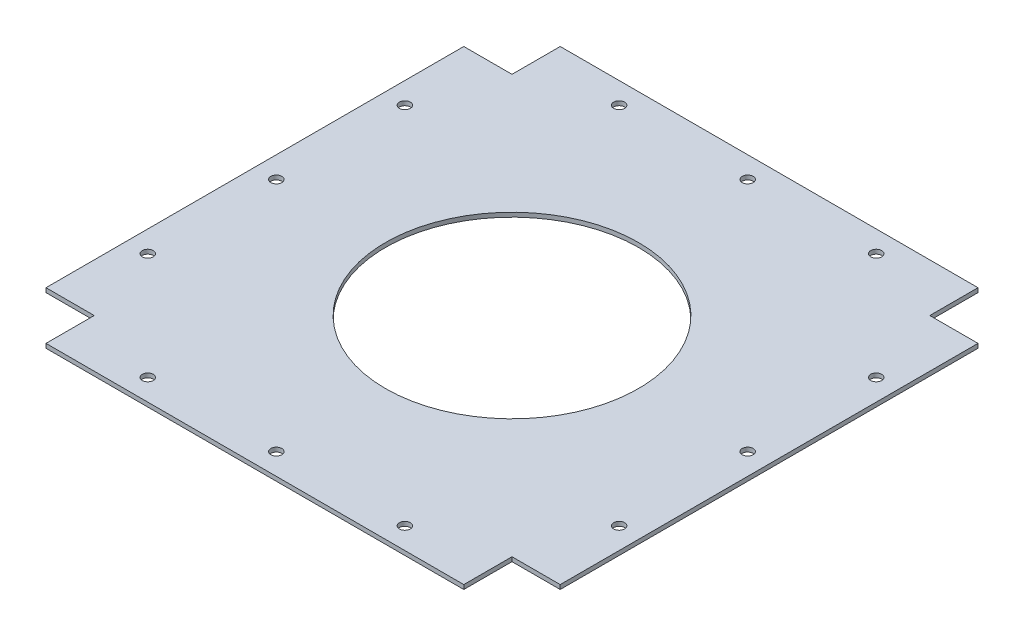
ISO-10303-21;
HEADER;
FILE_DESCRIPTION(('STEP AP214'),'2;1');
FILE_NAME('part.step','',(''),(''),'','','');
FILE_SCHEMA(('AUTOMOTIVE_DESIGN { 1 0 10303 214 1 1 1 1 }'));
ENDSEC;
DATA;
#1=APPLICATION_CONTEXT('core data for automotive mechanical design processes');
#2=APPLICATION_PROTOCOL_DEFINITION('international standard','automotive_design',2000,#1);
#3=PRODUCT_CONTEXT('',#1,'mechanical');
#4=PRODUCT('Part','Part','',(#3));
#5=PRODUCT_RELATED_PRODUCT_CATEGORY('part','',(#4));
#6=PRODUCT_DEFINITION_FORMATION('','',#4);
#7=PRODUCT_DEFINITION_CONTEXT('part definition',#1,'design');
#8=PRODUCT_DEFINITION('design','',#6,#7);
#9=PRODUCT_DEFINITION_SHAPE('','',#8);
#10=(LENGTH_UNIT() NAMED_UNIT(*) SI_UNIT(.MILLI.,.METRE.));
#11=(NAMED_UNIT(*) PLANE_ANGLE_UNIT() SI_UNIT($,.RADIAN.));
#12=(NAMED_UNIT(*) SI_UNIT($,.STERADIAN.) SOLID_ANGLE_UNIT());
#13=UNCERTAINTY_MEASURE_WITH_UNIT(LENGTH_MEASURE(1.E-05),#10,'distance_accuracy_value','');
#14=(GEOMETRIC_REPRESENTATION_CONTEXT(3) GLOBAL_UNCERTAINTY_ASSIGNED_CONTEXT((#13)) GLOBAL_UNIT_ASSIGNED_CONTEXT((#10,
#11,#12)) REPRESENTATION_CONTEXT('',''));
#15=CARTESIAN_POINT('',(0.,0.,0.));
#16=DIRECTION('',(0.,0.,1.));
#17=DIRECTION('',(1.,0.,0.));
#18=AXIS2_PLACEMENT_3D('',#15,#16,#17);
#19=CARTESIAN_POINT('',(0.,2.54,0.));
#20=DIRECTION('',(0.,-1.,0.));
#21=DIRECTION('',(0.,0.,-1.));
#22=AXIS2_PLACEMENT_3D('',#19,#20,#21);
#23=PLANE('',#22);
#24=CARTESIAN_POINT('',(-139.7,2.54,76.1999999999999));
#25=DIRECTION('',(0.,1.,0.));
#26=DIRECTION('',(0.,0.,-1.));
#27=AXIS2_PLACEMENT_3D('',#24,#25,#26);
#28=CIRCLE('',#27,3.23850000000002);
#29=CARTESIAN_POINT('',(-139.7,2.54,72.9614999999999));
#30=VERTEX_POINT('',#29);
#31=EDGE_CURVE('E330',#30,#30,#28,.T.);
#32=ORIENTED_EDGE('',*,*,#31,.F.);
#33=EDGE_LOOP('',(#32));
#34=FACE_BOUND('',#33,.T.);
#35=CARTESIAN_POINT('',(-139.7,2.54,-76.2));
#36=DIRECTION('',(0.,1.,0.));
#37=DIRECTION('',(0.,0.,-1.));
#38=AXIS2_PLACEMENT_3D('',#35,#36,#37);
#39=CIRCLE('',#38,3.23850000000001);
#40=CARTESIAN_POINT('',(-139.7,2.54,-79.4385));
#41=VERTEX_POINT('',#40);
#42=EDGE_CURVE('E342',#41,#41,#39,.T.);
#43=ORIENTED_EDGE('',*,*,#42,.F.);
#44=EDGE_LOOP('',(#43));
#45=FACE_BOUND('',#44,.T.);
#46=CARTESIAN_POINT('',(139.7,2.54,-1.11022302462516E-13));
#47=DIRECTION('',(0.,1.,0.));
#48=DIRECTION('',(0.,0.,1.));
#49=AXIS2_PLACEMENT_3D('',#46,#47,#48);
#50=CIRCLE('',#49,3.23850000000011);
#51=CARTESIAN_POINT('',(139.7,2.54,3.2385));
#52=VERTEX_POINT('',#51);
#53=EDGE_CURVE('E354',#52,#52,#50,.T.);
#54=ORIENTED_EDGE('',*,*,#53,.F.);
#55=EDGE_LOOP('',(#54));
#56=FACE_BOUND('',#55,.T.);
#57=CARTESIAN_POINT('',(76.2,2.54,139.7));
#58=DIRECTION('',(0.,1.,0.));
#59=DIRECTION('',(0.,0.,-1.));
#60=AXIS2_PLACEMENT_3D('',#57,#58,#59);
#61=CIRCLE('',#60,3.23850000000002);
#62=CARTESIAN_POINT('',(76.2,2.54,136.4615));
#63=VERTEX_POINT('',#62);
#64=EDGE_CURVE('E366',#63,#63,#61,.T.);
#65=ORIENTED_EDGE('',*,*,#64,.F.);
#66=EDGE_LOOP('',(#65));
#67=FACE_BOUND('',#66,.T.);
#68=CARTESIAN_POINT('',(-76.2,2.54,139.7));
#69=DIRECTION('',(0.,1.,0.));
#70=DIRECTION('',(0.,0.,-1.));
#71=AXIS2_PLACEMENT_3D('',#68,#69,#70);
#72=CIRCLE('',#71,3.23849999999999);
#73=CARTESIAN_POINT('',(-76.2,2.54,136.4615));
#74=VERTEX_POINT('',#73);
#75=EDGE_CURVE('E378',#74,#74,#72,.T.);
#76=ORIENTED_EDGE('',*,*,#75,.F.);
#77=EDGE_LOOP('',(#76));
#78=FACE_BOUND('',#77,.T.);
#79=CARTESIAN_POINT('',(0.,2.54,-139.7));
#80=DIRECTION('',(0.,1.,0.));
#81=DIRECTION('',(0.,0.,1.));
#82=AXIS2_PLACEMENT_3D('',#79,#80,#81);
#83=CIRCLE('',#82,3.2385);
#84=CARTESIAN_POINT('',(0.,2.54,-136.4615));
#85=VERTEX_POINT('',#84);
#86=EDGE_CURVE('E390',#85,#85,#83,.T.);
#87=ORIENTED_EDGE('',*,*,#86,.F.);
#88=EDGE_LOOP('',(#87));
#89=FACE_BOUND('',#88,.T.);
#90=DIRECTION('',(-1.,0.,0.));
#91=VECTOR('',#90,1.);
#92=CARTESIAN_POINT('',(-123.825,2.54,-152.4));
#93=LINE('',#92,#91);
#94=CARTESIAN_POINT('',(123.825,2.54,-152.4));
#95=VERTEX_POINT('',#94);
#96=CARTESIAN_POINT('',(-123.825,2.54,-152.4));
#97=VERTEX_POINT('',#96);
#98=EDGE_CURVE('E179',#95,#97,#93,.T.);
#99=ORIENTED_EDGE('',*,*,#98,.T.);
#100=DIRECTION('',(0.,0.,1.));
#101=VECTOR('',#100,1.);
#102=CARTESIAN_POINT('',(-123.825,2.54,-123.825));
#103=LINE('',#102,#101);
#104=CARTESIAN_POINT('',(-123.825,2.54,-123.825));
#105=VERTEX_POINT('',#104);
#106=EDGE_CURVE('E107',#97,#105,#103,.T.);
#107=ORIENTED_EDGE('',*,*,#106,.T.);
#108=DIRECTION('',(-1.,0.,0.));
#109=VECTOR('',#108,1.);
#110=CARTESIAN_POINT('',(-152.4,2.54,-123.825));
#111=LINE('',#110,#109);
#112=CARTESIAN_POINT('',(-152.4,2.54,-123.825));
#113=VERTEX_POINT('',#112);
#114=EDGE_CURVE('E206',#105,#113,#111,.T.);
#115=ORIENTED_EDGE('',*,*,#114,.T.);
#116=DIRECTION('',(0.,0.,1.));
#117=VECTOR('',#116,1.);
#118=CARTESIAN_POINT('',(-152.4,2.54,123.825));
#119=LINE('',#118,#117);
#120=CARTESIAN_POINT('',(-152.4,2.54,123.825));
#121=VERTEX_POINT('',#120);
#122=EDGE_CURVE('E225',#113,#121,#119,.T.);
#123=ORIENTED_EDGE('',*,*,#122,.T.);
#124=DIRECTION('',(1.,0.,0.));
#125=VECTOR('',#124,1.);
#126=CARTESIAN_POINT('',(-152.4,2.54,123.825));
#127=LINE('',#126,#125);
#128=CARTESIAN_POINT('',(-123.825,2.54,123.825));
#129=VERTEX_POINT('',#128);
#130=EDGE_CURVE('E222',#121,#129,#127,.T.);
#131=ORIENTED_EDGE('',*,*,#130,.T.);
#132=DIRECTION('',(0.,0.,1.));
#133=VECTOR('',#132,1.);
#134=CARTESIAN_POINT('',(-123.825,2.54,123.825));
#135=LINE('',#134,#133);
#136=CARTESIAN_POINT('',(-123.825,2.54,152.4));
#137=VERTEX_POINT('',#136);
#138=EDGE_CURVE('E224',#129,#137,#135,.T.);
#139=ORIENTED_EDGE('',*,*,#138,.T.);
#140=DIRECTION('',(1.,0.,0.));
#141=VECTOR('',#140,1.);
#142=CARTESIAN_POINT('',(-123.825,2.54,152.4));
#143=LINE('',#142,#141);
#144=CARTESIAN_POINT('',(123.825,2.54,152.4));
#145=VERTEX_POINT('',#144);
#146=EDGE_CURVE('E227',#137,#145,#143,.T.);
#147=ORIENTED_EDGE('',*,*,#146,.T.);
#148=DIRECTION('',(0.,0.,-1.));
#149=VECTOR('',#148,1.);
#150=CARTESIAN_POINT('',(123.825,2.54,152.4));
#151=LINE('',#150,#149);
#152=CARTESIAN_POINT('',(123.825,2.54,123.825));
#153=VERTEX_POINT('',#152);
#154=EDGE_CURVE('E233',#145,#153,#151,.T.);
#155=ORIENTED_EDGE('',*,*,#154,.T.);
#156=DIRECTION('',(1.,0.,0.));
#157=VECTOR('',#156,1.);
#158=CARTESIAN_POINT('',(123.825,2.54,123.825));
#159=LINE('',#158,#157);
#160=CARTESIAN_POINT('',(152.4,2.54,123.825));
#161=VERTEX_POINT('',#160);
#162=EDGE_CURVE('E138',#153,#161,#159,.T.);
#163=ORIENTED_EDGE('',*,*,#162,.T.);
#164=DIRECTION('',(0.,0.,-1.));
#165=VECTOR('',#164,1.);
#166=CARTESIAN_POINT('',(152.4,2.54,123.825));
#167=LINE('',#166,#165);
#168=CARTESIAN_POINT('',(152.4,2.54,-123.825));
#169=VERTEX_POINT('',#168);
#170=EDGE_CURVE('E132',#161,#169,#167,.T.);
#171=ORIENTED_EDGE('',*,*,#170,.T.);
#172=DIRECTION('',(-1.,0.,0.));
#173=VECTOR('',#172,1.);
#174=CARTESIAN_POINT('',(123.825,2.54,-123.825));
#175=LINE('',#174,#173);
#176=CARTESIAN_POINT('',(123.825,2.54,-123.825));
#177=VERTEX_POINT('',#176);
#178=EDGE_CURVE('E136',#169,#177,#175,.T.);
#179=ORIENTED_EDGE('',*,*,#178,.T.);
#180=DIRECTION('',(0.,0.,-1.));
#181=VECTOR('',#180,1.);
#182=CARTESIAN_POINT('',(123.825,2.54,-152.4));
#183=LINE('',#182,#181);
#184=EDGE_CURVE('E52',#177,#95,#183,.T.);
#185=ORIENTED_EDGE('',*,*,#184,.T.);
#186=EDGE_LOOP('',(#99,#107,#115,#123,#131,#139,#147,#155,#163,#171,#179,#185));
#187=FACE_BOUND('',#186,.T.);
#188=CARTESIAN_POINT('',(76.2,2.54,-139.7));
#189=DIRECTION('',(0.,1.,0.));
#190=DIRECTION('',(0.,0.,1.));
#191=AXIS2_PLACEMENT_3D('',#188,#189,#190);
#192=CIRCLE('',#191,3.2385);
#193=CARTESIAN_POINT('',(76.2,2.54,-136.4615));
#194=VERTEX_POINT('',#193);
#195=EDGE_CURVE('E160',#194,#194,#192,.T.);
#196=ORIENTED_EDGE('',*,*,#195,.F.);
#197=EDGE_LOOP('',(#196));
#198=FACE_BOUND('',#197,.T.);
#199=CARTESIAN_POINT('',(-76.2,2.54,-139.7));
#200=DIRECTION('',(0.,1.,0.));
#201=DIRECTION('',(0.,0.,1.));
#202=AXIS2_PLACEMENT_3D('',#199,#200,#201);
#203=CIRCLE('',#202,3.2385);
#204=CARTESIAN_POINT('',(-76.2,2.54,-136.4615));
#205=VERTEX_POINT('',#204);
#206=EDGE_CURVE('E384',#205,#205,#203,.T.);
#207=ORIENTED_EDGE('',*,*,#206,.F.);
#208=EDGE_LOOP('',(#207));
#209=FACE_BOUND('',#208,.T.);
#210=CARTESIAN_POINT('',(0.,2.54,139.7));
#211=DIRECTION('',(0.,1.,0.));
#212=DIRECTION('',(0.,0.,-1.));
#213=AXIS2_PLACEMENT_3D('',#210,#211,#212);
#214=CIRCLE('',#213,3.23850000000002);
#215=CARTESIAN_POINT('',(0.,2.54,136.4615));
#216=VERTEX_POINT('',#215);
#217=EDGE_CURVE('E372',#216,#216,#214,.T.);
#218=ORIENTED_EDGE('',*,*,#217,.F.);
#219=EDGE_LOOP('',(#218));
#220=FACE_BOUND('',#219,.T.);
#221=CARTESIAN_POINT('',(139.7,2.54,76.1999999999999));
#222=DIRECTION('',(0.,1.,0.));
#223=DIRECTION('',(0.,0.,1.));
#224=AXIS2_PLACEMENT_3D('',#221,#222,#223);
#225=CIRCLE('',#224,3.23850000000004);
#226=CARTESIAN_POINT('',(139.7,2.54,79.4384999999999));
#227=VERTEX_POINT('',#226);
#228=EDGE_CURVE('E360',#227,#227,#225,.T.);
#229=ORIENTED_EDGE('',*,*,#228,.F.);
#230=EDGE_LOOP('',(#229));
#231=FACE_BOUND('',#230,.T.);
#232=CARTESIAN_POINT('',(139.7,2.54,-76.2000000000001));
#233=DIRECTION('',(0.,1.,0.));
#234=DIRECTION('',(0.,0.,1.));
#235=AXIS2_PLACEMENT_3D('',#232,#233,#234);
#236=CIRCLE('',#235,3.23850000000008);
#237=CARTESIAN_POINT('',(139.7,2.54,-72.9615000000001));
#238=VERTEX_POINT('',#237);
#239=EDGE_CURVE('E348',#238,#238,#236,.T.);
#240=ORIENTED_EDGE('',*,*,#239,.F.);
#241=EDGE_LOOP('',(#240));
#242=FACE_BOUND('',#241,.T.);
#243=CARTESIAN_POINT('',(-139.7,2.54,0.));
#244=DIRECTION('',(0.,1.,0.));
#245=DIRECTION('',(0.,0.,-1.));
#246=AXIS2_PLACEMENT_3D('',#243,#244,#245);
#247=CIRCLE('',#246,3.2385);
#248=CARTESIAN_POINT('',(-139.7,2.54,-3.23850000000006));
#249=VERTEX_POINT('',#248);
#250=EDGE_CURVE('E336',#249,#249,#247,.T.);
#251=ORIENTED_EDGE('',*,*,#250,.F.);
#252=EDGE_LOOP('',(#251));
#253=FACE_BOUND('',#252,.T.);
#254=CARTESIAN_POINT('',(0.,2.54,0.));
#255=DIRECTION('',(0.,1.,0.));
#256=DIRECTION('',(0.,0.,1.));
#257=AXIS2_PLACEMENT_3D('',#254,#255,#256);
#258=CIRCLE('',#257,75.);
#259=CARTESIAN_POINT('',(0.,2.54,75.));
#260=VERTEX_POINT('',#259);
#261=EDGE_CURVE('E321',#260,#260,#258,.T.);
#262=ORIENTED_EDGE('',*,*,#261,.F.);
#263=EDGE_LOOP('',(#262));
#264=FACE_BOUND('',#263,.T.);
#265=ADVANCED_FACE('F35',(#34,#45,#56,#67,#78,#89,#187,#198,#209,#220,#231,#242,#253,#264),#23,.F.);
#266=CARTESIAN_POINT('',(0.,0.,0.));
#267=DIRECTION('',(0.,-1.,0.));
#268=DIRECTION('',(0.,0.,-1.));
#269=AXIS2_PLACEMENT_3D('',#266,#267,#268);
#270=PLANE('',#269);
#271=CARTESIAN_POINT('',(-139.7,0.,76.1999999999999));
#272=DIRECTION('',(0.,1.,0.));
#273=DIRECTION('',(0.,0.,-1.));
#274=AXIS2_PLACEMENT_3D('',#271,#272,#273);
#275=CIRCLE('',#274,3.23850000000002);
#276=CARTESIAN_POINT('',(-139.7,0.,72.9614999999999));
#277=VERTEX_POINT('',#276);
#278=EDGE_CURVE('E327',#277,#277,#275,.T.);
#279=ORIENTED_EDGE('',*,*,#278,.T.);
#280=EDGE_LOOP('',(#279));
#281=FACE_BOUND('',#280,.T.);
#282=CARTESIAN_POINT('',(-139.7,0.,-76.2));
#283=DIRECTION('',(0.,1.,0.));
#284=DIRECTION('',(0.,0.,-1.));
#285=AXIS2_PLACEMENT_3D('',#282,#283,#284);
#286=CIRCLE('',#285,3.23850000000001);
#287=CARTESIAN_POINT('',(-139.7,0.,-79.4385));
#288=VERTEX_POINT('',#287);
#289=EDGE_CURVE('E339',#288,#288,#286,.T.);
#290=ORIENTED_EDGE('',*,*,#289,.T.);
#291=EDGE_LOOP('',(#290));
#292=FACE_BOUND('',#291,.T.);
#293=CARTESIAN_POINT('',(139.7,0.,-1.11022302462516E-13));
#294=DIRECTION('',(0.,1.,0.));
#295=DIRECTION('',(0.,0.,1.));
#296=AXIS2_PLACEMENT_3D('',#293,#294,#295);
#297=CIRCLE('',#296,3.23850000000011);
#298=CARTESIAN_POINT('',(139.7,0.,3.2385));
#299=VERTEX_POINT('',#298);
#300=EDGE_CURVE('E351',#299,#299,#297,.T.);
#301=ORIENTED_EDGE('',*,*,#300,.T.);
#302=EDGE_LOOP('',(#301));
#303=FACE_BOUND('',#302,.T.);
#304=CARTESIAN_POINT('',(76.2,0.,139.7));
#305=DIRECTION('',(0.,1.,0.));
#306=DIRECTION('',(0.,0.,-1.));
#307=AXIS2_PLACEMENT_3D('',#304,#305,#306);
#308=CIRCLE('',#307,3.23850000000002);
#309=CARTESIAN_POINT('',(76.2,0.,136.4615));
#310=VERTEX_POINT('',#309);
#311=EDGE_CURVE('E363',#310,#310,#308,.T.);
#312=ORIENTED_EDGE('',*,*,#311,.T.);
#313=EDGE_LOOP('',(#312));
#314=FACE_BOUND('',#313,.T.);
#315=CARTESIAN_POINT('',(-76.2,0.,139.7));
#316=DIRECTION('',(0.,1.,0.));
#317=DIRECTION('',(0.,0.,-1.));
#318=AXIS2_PLACEMENT_3D('',#315,#316,#317);
#319=CIRCLE('',#318,3.23849999999999);
#320=CARTESIAN_POINT('',(-76.2,0.,136.4615));
#321=VERTEX_POINT('',#320);
#322=EDGE_CURVE('E375',#321,#321,#319,.T.);
#323=ORIENTED_EDGE('',*,*,#322,.T.);
#324=EDGE_LOOP('',(#323));
#325=FACE_BOUND('',#324,.T.);
#326=CARTESIAN_POINT('',(0.,0.,-139.7));
#327=DIRECTION('',(0.,1.,0.));
#328=DIRECTION('',(0.,0.,1.));
#329=AXIS2_PLACEMENT_3D('',#326,#327,#328);
#330=CIRCLE('',#329,3.2385);
#331=CARTESIAN_POINT('',(0.,0.,-136.4615));
#332=VERTEX_POINT('',#331);
#333=EDGE_CURVE('E387',#332,#332,#330,.T.);
#334=ORIENTED_EDGE('',*,*,#333,.T.);
#335=EDGE_LOOP('',(#334));
#336=FACE_BOUND('',#335,.T.);
#337=DIRECTION('',(-1.,0.,0.));
#338=VECTOR('',#337,1.);
#339=CARTESIAN_POINT('',(-123.825,0.,-152.4));
#340=LINE('',#339,#338);
#341=CARTESIAN_POINT('',(123.825,0.,-152.4));
#342=VERTEX_POINT('',#341);
#343=CARTESIAN_POINT('',(-123.825,0.,-152.4));
#344=VERTEX_POINT('',#343);
#345=EDGE_CURVE('E156',#342,#344,#340,.T.);
#346=ORIENTED_EDGE('',*,*,#345,.F.);
#347=DIRECTION('',(0.,0.,-1.));
#348=VECTOR('',#347,1.);
#349=CARTESIAN_POINT('',(123.825,0.,-152.4));
#350=LINE('',#349,#348);
#351=CARTESIAN_POINT('',(123.825,0.,-123.825));
#352=VERTEX_POINT('',#351);
#353=EDGE_CURVE('E99',#352,#342,#350,.T.);
#354=ORIENTED_EDGE('',*,*,#353,.F.);
#355=DIRECTION('',(-1.,0.,0.));
#356=VECTOR('',#355,1.);
#357=CARTESIAN_POINT('',(123.825,0.,-123.825));
#358=LINE('',#357,#356);
#359=CARTESIAN_POINT('',(152.4,0.,-123.825));
#360=VERTEX_POINT('',#359);
#361=EDGE_CURVE('E93',#360,#352,#358,.T.);
#362=ORIENTED_EDGE('',*,*,#361,.F.);
#363=DIRECTION('',(0.,0.,-1.));
#364=VECTOR('',#363,1.);
#365=CARTESIAN_POINT('',(152.4,0.,123.825));
#366=LINE('',#365,#364);
#367=CARTESIAN_POINT('',(152.4,0.,123.825));
#368=VERTEX_POINT('',#367);
#369=EDGE_CURVE('E146',#368,#360,#366,.T.);
#370=ORIENTED_EDGE('',*,*,#369,.F.);
#371=DIRECTION('',(1.,0.,0.));
#372=VECTOR('',#371,1.);
#373=CARTESIAN_POINT('',(123.825,0.,123.825));
#374=LINE('',#373,#372);
#375=CARTESIAN_POINT('',(123.825,0.,123.825));
#376=VERTEX_POINT('',#375);
#377=EDGE_CURVE('E174',#376,#368,#374,.T.);
#378=ORIENTED_EDGE('',*,*,#377,.F.);
#379=DIRECTION('',(0.,0.,-1.));
#380=VECTOR('',#379,1.);
#381=CARTESIAN_POINT('',(123.825,0.,152.4));
#382=LINE('',#381,#380);
#383=CARTESIAN_POINT('',(123.825,0.,152.4));
#384=VERTEX_POINT('',#383);
#385=EDGE_CURVE('E172',#384,#376,#382,.T.);
#386=ORIENTED_EDGE('',*,*,#385,.F.);
#387=DIRECTION('',(1.,0.,0.));
#388=VECTOR('',#387,1.);
#389=CARTESIAN_POINT('',(-123.825,0.,152.4));
#390=LINE('',#389,#388);
#391=CARTESIAN_POINT('',(-123.825,0.,152.4));
#392=VERTEX_POINT('',#391);
#393=EDGE_CURVE('E170',#392,#384,#390,.T.);
#394=ORIENTED_EDGE('',*,*,#393,.F.);
#395=DIRECTION('',(0.,0.,1.));
#396=VECTOR('',#395,1.);
#397=CARTESIAN_POINT('',(-123.825,0.,123.825));
#398=LINE('',#397,#396);
#399=CARTESIAN_POINT('',(-123.825,0.,123.825));
#400=VERTEX_POINT('',#399);
#401=EDGE_CURVE('E168',#400,#392,#398,.T.);
#402=ORIENTED_EDGE('',*,*,#401,.F.);
#403=DIRECTION('',(1.,0.,0.));
#404=VECTOR('',#403,1.);
#405=CARTESIAN_POINT('',(-152.4,0.,123.825));
#406=LINE('',#405,#404);
#407=CARTESIAN_POINT('',(-152.4,0.,123.825));
#408=VERTEX_POINT('',#407);
#409=EDGE_CURVE('E166',#408,#400,#406,.T.);
#410=ORIENTED_EDGE('',*,*,#409,.F.);
#411=DIRECTION('',(0.,0.,1.));
#412=VECTOR('',#411,1.);
#413=CARTESIAN_POINT('',(-152.4,0.,123.825));
#414=LINE('',#413,#412);
#415=CARTESIAN_POINT('',(-152.4,0.,-123.825));
#416=VERTEX_POINT('',#415);
#417=EDGE_CURVE('E164',#416,#408,#414,.T.);
#418=ORIENTED_EDGE('',*,*,#417,.F.);
#419=DIRECTION('',(-1.,0.,0.));
#420=VECTOR('',#419,1.);
#421=CARTESIAN_POINT('',(-152.4,0.,-123.825));
#422=LINE('',#421,#420);
#423=CARTESIAN_POINT('',(-123.825,0.,-123.825));
#424=VERTEX_POINT('',#423);
#425=EDGE_CURVE('E162',#424,#416,#422,.T.);
#426=ORIENTED_EDGE('',*,*,#425,.F.);
#427=DIRECTION('',(0.,0.,1.));
#428=VECTOR('',#427,1.);
#429=CARTESIAN_POINT('',(-123.825,0.,-123.825));
#430=LINE('',#429,#428);
#431=EDGE_CURVE('E159',#344,#424,#430,.T.);
#432=ORIENTED_EDGE('',*,*,#431,.F.);
#433=EDGE_LOOP('',(#346,#354,#362,#370,#378,#386,#394,#402,#410,#418,#426,#432));
#434=FACE_BOUND('',#433,.T.);
#435=CARTESIAN_POINT('',(76.2,0.,-139.7));
#436=DIRECTION('',(0.,1.,0.));
#437=DIRECTION('',(0.,0.,1.));
#438=AXIS2_PLACEMENT_3D('',#435,#436,#437);
#439=CIRCLE('',#438,3.2385);
#440=CARTESIAN_POINT('',(76.2,0.,-136.4615));
#441=VERTEX_POINT('',#440);
#442=EDGE_CURVE('E393',#441,#441,#439,.T.);
#443=ORIENTED_EDGE('',*,*,#442,.T.);
#444=EDGE_LOOP('',(#443));
#445=FACE_BOUND('',#444,.T.);
#446=CARTESIAN_POINT('',(-76.2,0.,-139.7));
#447=DIRECTION('',(0.,1.,0.));
#448=DIRECTION('',(0.,0.,1.));
#449=AXIS2_PLACEMENT_3D('',#446,#447,#448);
#450=CIRCLE('',#449,3.2385);
#451=CARTESIAN_POINT('',(-76.2,0.,-136.4615));
#452=VERTEX_POINT('',#451);
#453=EDGE_CURVE('E381',#452,#452,#450,.T.);
#454=ORIENTED_EDGE('',*,*,#453,.T.);
#455=EDGE_LOOP('',(#454));
#456=FACE_BOUND('',#455,.T.);
#457=CARTESIAN_POINT('',(0.,0.,139.7));
#458=DIRECTION('',(0.,1.,0.));
#459=DIRECTION('',(0.,0.,-1.));
#460=AXIS2_PLACEMENT_3D('',#457,#458,#459);
#461=CIRCLE('',#460,3.23850000000002);
#462=CARTESIAN_POINT('',(0.,0.,136.4615));
#463=VERTEX_POINT('',#462);
#464=EDGE_CURVE('E369',#463,#463,#461,.T.);
#465=ORIENTED_EDGE('',*,*,#464,.T.);
#466=EDGE_LOOP('',(#465));
#467=FACE_BOUND('',#466,.T.);
#468=CARTESIAN_POINT('',(139.7,0.,76.1999999999999));
#469=DIRECTION('',(0.,1.,0.));
#470=DIRECTION('',(0.,0.,1.));
#471=AXIS2_PLACEMENT_3D('',#468,#469,#470);
#472=CIRCLE('',#471,3.23850000000004);
#473=CARTESIAN_POINT('',(139.7,0.,79.4384999999999));
#474=VERTEX_POINT('',#473);
#475=EDGE_CURVE('E357',#474,#474,#472,.T.);
#476=ORIENTED_EDGE('',*,*,#475,.T.);
#477=EDGE_LOOP('',(#476));
#478=FACE_BOUND('',#477,.T.);
#479=CARTESIAN_POINT('',(139.7,0.,-76.2000000000001));
#480=DIRECTION('',(0.,1.,0.));
#481=DIRECTION('',(0.,0.,1.));
#482=AXIS2_PLACEMENT_3D('',#479,#480,#481);
#483=CIRCLE('',#482,3.23850000000008);
#484=CARTESIAN_POINT('',(139.7,0.,-72.9615000000001));
#485=VERTEX_POINT('',#484);
#486=EDGE_CURVE('E345',#485,#485,#483,.T.);
#487=ORIENTED_EDGE('',*,*,#486,.T.);
#488=EDGE_LOOP('',(#487));
#489=FACE_BOUND('',#488,.T.);
#490=CARTESIAN_POINT('',(-139.7,0.,0.));
#491=DIRECTION('',(0.,1.,0.));
#492=DIRECTION('',(0.,0.,-1.));
#493=AXIS2_PLACEMENT_3D('',#490,#491,#492);
#494=CIRCLE('',#493,3.2385);
#495=CARTESIAN_POINT('',(-139.7,0.,-3.23850000000006));
#496=VERTEX_POINT('',#495);
#497=EDGE_CURVE('E333',#496,#496,#494,.T.);
#498=ORIENTED_EDGE('',*,*,#497,.T.);
#499=EDGE_LOOP('',(#498));
#500=FACE_BOUND('',#499,.T.);
#501=CARTESIAN_POINT('',(0.,0.,0.));
#502=DIRECTION('',(0.,1.,0.));
#503=DIRECTION('',(0.,0.,1.));
#504=AXIS2_PLACEMENT_3D('',#501,#502,#503);
#505=CIRCLE('',#504,75.);
#506=CARTESIAN_POINT('',(0.,0.,75.));
#507=VERTEX_POINT('',#506);
#508=EDGE_CURVE('E324',#507,#507,#505,.T.);
#509=ORIENTED_EDGE('',*,*,#508,.T.);
#510=EDGE_LOOP('',(#509));
#511=FACE_BOUND('',#510,.T.);
#512=ADVANCED_FACE('F210',(#281,#292,#303,#314,#325,#336,#434,#445,#456,#467,#478,#489,#500,
#511),#270,.T.);
#513=CARTESIAN_POINT('',(-123.825,2.54,-152.4));
#514=DIRECTION('',(0.,0.,1.));
#515=DIRECTION('',(1.,0.,0.));
#516=AXIS2_PLACEMENT_3D('',#513,#514,#515);
#517=PLANE('',#516);
#518=ORIENTED_EDGE('',*,*,#345,.T.);
#519=DIRECTION('',(0.,-1.,0.));
#520=VECTOR('',#519,1.);
#521=CARTESIAN_POINT('',(-123.825,2.54,-152.4));
#522=LINE('',#521,#520);
#523=EDGE_CURVE('E11',#97,#344,#522,.T.);
#524=ORIENTED_EDGE('',*,*,#523,.F.);
#525=ORIENTED_EDGE('',*,*,#98,.F.);
#526=DIRECTION('',(0.,-1.,0.));
#527=VECTOR('',#526,1.);
#528=CARTESIAN_POINT('',(123.825,2.54,-152.4));
#529=LINE('',#528,#527);
#530=EDGE_CURVE('E152',#95,#342,#529,.T.);
#531=ORIENTED_EDGE('',*,*,#530,.T.);
#532=EDGE_LOOP('',(#518,#524,#525,#531));
#533=FACE_BOUND('',#532,.T.);
#534=ADVANCED_FACE('F37',(#533),#517,.F.);
#535=CARTESIAN_POINT('',(-123.825,2.54,-123.825));
#536=DIRECTION('',(1.,0.,0.));
#537=DIRECTION('',(0.,0.,-1.));
#538=AXIS2_PLACEMENT_3D('',#535,#536,#537);
#539=PLANE('',#538);
#540=ORIENTED_EDGE('',*,*,#431,.T.);
#541=DIRECTION('',(0.,-1.,0.));
#542=VECTOR('',#541,1.);
#543=CARTESIAN_POINT('',(-123.825,2.54,-123.825));
#544=LINE('',#543,#542);
#545=EDGE_CURVE('E44',#105,#424,#544,.T.);
#546=ORIENTED_EDGE('',*,*,#545,.F.);
#547=ORIENTED_EDGE('',*,*,#106,.F.);
#548=ORIENTED_EDGE('',*,*,#523,.T.);
#549=EDGE_LOOP('',(#540,#546,#547,#548));
#550=FACE_BOUND('',#549,.T.);
#551=ADVANCED_FACE('F583',(#550),#539,.F.);
#552=CARTESIAN_POINT('',(-152.4,2.54,-123.825));
#553=DIRECTION('',(0.,0.,1.));
#554=DIRECTION('',(1.,0.,0.));
#555=AXIS2_PLACEMENT_3D('',#552,#553,#554);
#556=PLANE('',#555);
#557=ORIENTED_EDGE('',*,*,#425,.T.);
#558=DIRECTION('',(0.,-1.,0.));
#559=VECTOR('',#558,1.);
#560=CARTESIAN_POINT('',(-152.4,2.54,-123.825));
#561=LINE('',#560,#559);
#562=EDGE_CURVE('E198',#113,#416,#561,.T.);
#563=ORIENTED_EDGE('',*,*,#562,.F.);
#564=ORIENTED_EDGE('',*,*,#114,.F.);
#565=ORIENTED_EDGE('',*,*,#545,.T.);
#566=EDGE_LOOP('',(#557,#563,#564,#565));
#567=FACE_BOUND('',#566,.T.);
#568=ADVANCED_FACE('F204',(#567),#556,.F.);
#569=CARTESIAN_POINT('',(-152.4,2.54,123.825));
#570=DIRECTION('',(1.,0.,0.));
#571=DIRECTION('',(0.,0.,-1.));
#572=AXIS2_PLACEMENT_3D('',#569,#570,#571);
#573=PLANE('',#572);
#574=ORIENTED_EDGE('',*,*,#417,.T.);
#575=DIRECTION('',(0.,-1.,0.));
#576=VECTOR('',#575,1.);
#577=CARTESIAN_POINT('',(-152.4,2.54,123.825));
#578=LINE('',#577,#576);
#579=EDGE_CURVE('E195',#121,#408,#578,.T.);
#580=ORIENTED_EDGE('',*,*,#579,.F.);
#581=ORIENTED_EDGE('',*,*,#122,.F.);
#582=ORIENTED_EDGE('',*,*,#562,.T.);
#583=EDGE_LOOP('',(#574,#580,#581,#582));
#584=FACE_BOUND('',#583,.T.);
#585=ADVANCED_FACE('F216',(#584),#573,.F.);
#586=CARTESIAN_POINT('',(-152.4,2.54,123.825));
#587=DIRECTION('',(0.,0.,-1.));
#588=DIRECTION('',(-1.,0.,0.));
#589=AXIS2_PLACEMENT_3D('',#586,#587,#588);
#590=PLANE('',#589);
#591=ORIENTED_EDGE('',*,*,#409,.T.);
#592=DIRECTION('',(0.,-1.,0.));
#593=VECTOR('',#592,1.);
#594=CARTESIAN_POINT('',(-123.825,2.54,123.825));
#595=LINE('',#594,#593);
#596=EDGE_CURVE('E192',#129,#400,#595,.T.);
#597=ORIENTED_EDGE('',*,*,#596,.F.);
#598=ORIENTED_EDGE('',*,*,#130,.F.);
#599=ORIENTED_EDGE('',*,*,#579,.T.);
#600=EDGE_LOOP('',(#591,#597,#598,#599));
#601=FACE_BOUND('',#600,.T.);
#602=ADVANCED_FACE('F220',(#601),#590,.F.);
#603=CARTESIAN_POINT('',(-123.825,2.54,123.825));
#604=DIRECTION('',(1.,0.,0.));
#605=DIRECTION('',(0.,0.,-1.));
#606=AXIS2_PLACEMENT_3D('',#603,#604,#605);
#607=PLANE('',#606);
#608=ORIENTED_EDGE('',*,*,#401,.T.);
#609=DIRECTION('',(0.,-1.,0.));
#610=VECTOR('',#609,1.);
#611=CARTESIAN_POINT('',(-123.825,2.54,152.4));
#612=LINE('',#611,#610);
#613=EDGE_CURVE('E189',#137,#392,#612,.T.);
#614=ORIENTED_EDGE('',*,*,#613,.F.);
#615=ORIENTED_EDGE('',*,*,#138,.F.);
#616=ORIENTED_EDGE('',*,*,#596,.T.);
#617=EDGE_LOOP('',(#608,#614,#615,#616));
#618=FACE_BOUND('',#617,.T.);
#619=ADVANCED_FACE('F548',(#618),#607,.F.);
#620=CARTESIAN_POINT('',(-123.825,2.54,152.4));
#621=DIRECTION('',(0.,0.,-1.));
#622=DIRECTION('',(-1.,0.,0.));
#623=AXIS2_PLACEMENT_3D('',#620,#621,#622);
#624=PLANE('',#623);
#625=ORIENTED_EDGE('',*,*,#393,.T.);
#626=DIRECTION('',(0.,-1.,0.));
#627=VECTOR('',#626,1.);
#628=CARTESIAN_POINT('',(123.825,2.54,152.4));
#629=LINE('',#628,#627);
#630=EDGE_CURVE('E186',#145,#384,#629,.T.);
#631=ORIENTED_EDGE('',*,*,#630,.F.);
#632=ORIENTED_EDGE('',*,*,#146,.F.);
#633=ORIENTED_EDGE('',*,*,#613,.T.);
#634=EDGE_LOOP('',(#625,#631,#632,#633));
#635=FACE_BOUND('',#634,.T.);
#636=ADVANCED_FACE('F539',(#635),#624,.F.);
#637=CARTESIAN_POINT('',(123.825,2.54,152.4));
#638=DIRECTION('',(-1.,0.,0.));
#639=DIRECTION('',(0.,0.,1.));
#640=AXIS2_PLACEMENT_3D('',#637,#638,#639);
#641=PLANE('',#640);
#642=ORIENTED_EDGE('',*,*,#385,.T.);
#643=DIRECTION('',(0.,-1.,0.));
#644=VECTOR('',#643,1.);
#645=CARTESIAN_POINT('',(123.825,2.54,123.825));
#646=LINE('',#645,#644);
#647=EDGE_CURVE('E183',#153,#376,#646,.T.);
#648=ORIENTED_EDGE('',*,*,#647,.F.);
#649=ORIENTED_EDGE('',*,*,#154,.F.);
#650=ORIENTED_EDGE('',*,*,#630,.T.);
#651=EDGE_LOOP('',(#642,#648,#649,#650));
#652=FACE_BOUND('',#651,.T.);
#653=ADVANCED_FACE('F239',(#652),#641,.F.);
#654=CARTESIAN_POINT('',(123.825,2.54,123.825));
#655=DIRECTION('',(0.,0.,-1.));
#656=DIRECTION('',(-1.,0.,0.));
#657=AXIS2_PLACEMENT_3D('',#654,#655,#656);
#658=PLANE('',#657);
#659=ORIENTED_EDGE('',*,*,#377,.T.);
#660=DIRECTION('',(0.,-1.,0.));
#661=VECTOR('',#660,1.);
#662=CARTESIAN_POINT('',(152.4,2.54,123.825));
#663=LINE('',#662,#661);
#664=EDGE_CURVE('E147',#161,#368,#663,.T.);
#665=ORIENTED_EDGE('',*,*,#664,.F.);
#666=ORIENTED_EDGE('',*,*,#162,.F.);
#667=ORIENTED_EDGE('',*,*,#647,.T.);
#668=EDGE_LOOP('',(#659,#665,#666,#667));
#669=FACE_BOUND('',#668,.T.);
#670=ADVANCED_FACE('F243',(#669),#658,.F.);
#671=CARTESIAN_POINT('',(152.4,2.54,123.825));
#672=DIRECTION('',(-1.,0.,0.));
#673=DIRECTION('',(0.,0.,1.));
#674=AXIS2_PLACEMENT_3D('',#671,#672,#673);
#675=PLANE('',#674);
#676=ORIENTED_EDGE('',*,*,#369,.T.);
#677=DIRECTION('',(0.,-1.,0.));
#678=VECTOR('',#677,1.);
#679=CARTESIAN_POINT('',(152.4,2.54,-123.825));
#680=LINE('',#679,#678);
#681=EDGE_CURVE('E143',#169,#360,#680,.T.);
#682=ORIENTED_EDGE('',*,*,#681,.F.);
#683=ORIENTED_EDGE('',*,*,#170,.F.);
#684=ORIENTED_EDGE('',*,*,#664,.T.);
#685=EDGE_LOOP('',(#676,#682,#683,#684));
#686=FACE_BOUND('',#685,.T.);
#687=ADVANCED_FACE('F144',(#686),#675,.F.);
#688=CARTESIAN_POINT('',(123.825,2.54,-123.825));
#689=DIRECTION('',(0.,0.,1.));
#690=DIRECTION('',(1.,0.,0.));
#691=AXIS2_PLACEMENT_3D('',#688,#689,#690);
#692=PLANE('',#691);
#693=ORIENTED_EDGE('',*,*,#361,.T.);
#694=DIRECTION('',(0.,-1.,0.));
#695=VECTOR('',#694,1.);
#696=CARTESIAN_POINT('',(123.825,2.54,-123.825));
#697=LINE('',#696,#695);
#698=EDGE_CURVE('E148',#177,#352,#697,.T.);
#699=ORIENTED_EDGE('',*,*,#698,.F.);
#700=ORIENTED_EDGE('',*,*,#178,.F.);
#701=ORIENTED_EDGE('',*,*,#681,.T.);
#702=EDGE_LOOP('',(#693,#699,#700,#701));
#703=FACE_BOUND('',#702,.T.);
#704=ADVANCED_FACE('F150',(#703),#692,.F.);
#705=CARTESIAN_POINT('',(123.825,2.54,-152.4));
#706=DIRECTION('',(-1.,0.,0.));
#707=DIRECTION('',(0.,0.,1.));
#708=AXIS2_PLACEMENT_3D('',#705,#706,#707);
#709=PLANE('',#708);
#710=ORIENTED_EDGE('',*,*,#353,.T.);
#711=ORIENTED_EDGE('',*,*,#530,.F.);
#712=ORIENTED_EDGE('',*,*,#184,.F.);
#713=ORIENTED_EDGE('',*,*,#698,.T.);
#714=EDGE_LOOP('',(#710,#711,#712,#713));
#715=FACE_BOUND('',#714,.T.);
#716=ADVANCED_FACE('F247',(#715),#709,.F.);
#717=CARTESIAN_POINT('',(76.2,2.54,-139.7));
#718=DIRECTION('',(0.,-1.,0.));
#719=DIRECTION('',(0.,0.,-1.));
#720=AXIS2_PLACEMENT_3D('',#717,#718,#719);
#721=CYLINDRICAL_SURFACE('',#720,3.2385);
#722=ORIENTED_EDGE('',*,*,#195,.T.);
#723=EDGE_LOOP('',(#722));
#724=FACE_BOUND('',#723,.T.);
#725=ORIENTED_EDGE('',*,*,#442,.F.);
#726=EDGE_LOOP('',(#725));
#727=FACE_BOUND('',#726,.T.);
#728=ADVANCED_FACE('F249',(#724,#727),#721,.F.);
#729=CARTESIAN_POINT('',(0.,2.54,-139.7));
#730=DIRECTION('',(0.,-1.,0.));
#731=DIRECTION('',(0.,0.,-1.));
#732=AXIS2_PLACEMENT_3D('',#729,#730,#731);
#733=CYLINDRICAL_SURFACE('',#732,3.2385);
#734=ORIENTED_EDGE('',*,*,#86,.T.);
#735=EDGE_LOOP('',(#734));
#736=FACE_BOUND('',#735,.T.);
#737=ORIENTED_EDGE('',*,*,#333,.F.);
#738=EDGE_LOOP('',(#737));
#739=FACE_BOUND('',#738,.T.);
#740=ADVANCED_FACE('F255',(#736,#739),#733,.F.);
#741=CARTESIAN_POINT('',(-76.2,2.54,-139.7));
#742=DIRECTION('',(0.,-1.,0.));
#743=DIRECTION('',(0.,0.,-1.));
#744=AXIS2_PLACEMENT_3D('',#741,#742,#743);
#745=CYLINDRICAL_SURFACE('',#744,3.2385);
#746=ORIENTED_EDGE('',*,*,#206,.T.);
#747=EDGE_LOOP('',(#746));
#748=FACE_BOUND('',#747,.T.);
#749=ORIENTED_EDGE('',*,*,#453,.F.);
#750=EDGE_LOOP('',(#749));
#751=FACE_BOUND('',#750,.T.);
#752=ADVANCED_FACE('F272',(#748,#751),#745,.F.);
#753=CARTESIAN_POINT('',(-76.2,2.54,139.7));
#754=DIRECTION('',(0.,-1.,0.));
#755=DIRECTION('',(0.,0.,-1.));
#756=AXIS2_PLACEMENT_3D('',#753,#754,#755);
#757=CYLINDRICAL_SURFACE('',#756,3.23849999999999);
#758=ORIENTED_EDGE('',*,*,#75,.T.);
#759=EDGE_LOOP('',(#758));
#760=FACE_BOUND('',#759,.T.);
#761=ORIENTED_EDGE('',*,*,#322,.F.);
#762=EDGE_LOOP('',(#761));
#763=FACE_BOUND('',#762,.T.);
#764=ADVANCED_FACE('F276',(#760,#763),#757,.F.);
#765=CARTESIAN_POINT('',(0.,2.54,139.7));
#766=DIRECTION('',(0.,-1.,0.));
#767=DIRECTION('',(0.,0.,-1.));
#768=AXIS2_PLACEMENT_3D('',#765,#766,#767);
#769=CYLINDRICAL_SURFACE('',#768,3.23850000000002);
#770=ORIENTED_EDGE('',*,*,#217,.T.);
#771=EDGE_LOOP('',(#770));
#772=FACE_BOUND('',#771,.T.);
#773=ORIENTED_EDGE('',*,*,#464,.F.);
#774=EDGE_LOOP('',(#773));
#775=FACE_BOUND('',#774,.T.);
#776=ADVANCED_FACE('F280',(#772,#775),#769,.F.);
#777=CARTESIAN_POINT('',(76.2,2.54,139.7));
#778=DIRECTION('',(0.,-1.,0.));
#779=DIRECTION('',(0.,0.,-1.));
#780=AXIS2_PLACEMENT_3D('',#777,#778,#779);
#781=CYLINDRICAL_SURFACE('',#780,3.23850000000002);
#782=ORIENTED_EDGE('',*,*,#64,.T.);
#783=EDGE_LOOP('',(#782));
#784=FACE_BOUND('',#783,.T.);
#785=ORIENTED_EDGE('',*,*,#311,.F.);
#786=EDGE_LOOP('',(#785));
#787=FACE_BOUND('',#786,.T.);
#788=ADVANCED_FACE('F284',(#784,#787),#781,.F.);
#789=CARTESIAN_POINT('',(139.7,2.54,76.1999999999999));
#790=DIRECTION('',(0.,-1.,0.));
#791=DIRECTION('',(0.,0.,-1.));
#792=AXIS2_PLACEMENT_3D('',#789,#790,#791);
#793=CYLINDRICAL_SURFACE('',#792,3.23850000000004);
#794=ORIENTED_EDGE('',*,*,#228,.T.);
#795=EDGE_LOOP('',(#794));
#796=FACE_BOUND('',#795,.T.);
#797=ORIENTED_EDGE('',*,*,#475,.F.);
#798=EDGE_LOOP('',(#797));
#799=FACE_BOUND('',#798,.T.);
#800=ADVANCED_FACE('F288',(#796,#799),#793,.F.);
#801=CARTESIAN_POINT('',(139.7,2.54,-1.11022302462516E-13));
#802=DIRECTION('',(0.,-1.,0.));
#803=DIRECTION('',(0.,0.,-1.));
#804=AXIS2_PLACEMENT_3D('',#801,#802,#803);
#805=CYLINDRICAL_SURFACE('',#804,3.23850000000011);
#806=ORIENTED_EDGE('',*,*,#53,.T.);
#807=EDGE_LOOP('',(#806));
#808=FACE_BOUND('',#807,.T.);
#809=ORIENTED_EDGE('',*,*,#300,.F.);
#810=EDGE_LOOP('',(#809));
#811=FACE_BOUND('',#810,.T.);
#812=ADVANCED_FACE('F292',(#808,#811),#805,.F.);
#813=CARTESIAN_POINT('',(139.7,2.54,-76.2000000000001));
#814=DIRECTION('',(0.,-1.,0.));
#815=DIRECTION('',(0.,0.,-1.));
#816=AXIS2_PLACEMENT_3D('',#813,#814,#815);
#817=CYLINDRICAL_SURFACE('',#816,3.23850000000008);
#818=ORIENTED_EDGE('',*,*,#239,.T.);
#819=EDGE_LOOP('',(#818));
#820=FACE_BOUND('',#819,.T.);
#821=ORIENTED_EDGE('',*,*,#486,.F.);
#822=EDGE_LOOP('',(#821));
#823=FACE_BOUND('',#822,.T.);
#824=ADVANCED_FACE('F296',(#820,#823),#817,.F.);
#825=CARTESIAN_POINT('',(-139.7,2.54,-76.2));
#826=DIRECTION('',(0.,-1.,0.));
#827=DIRECTION('',(0.,0.,-1.));
#828=AXIS2_PLACEMENT_3D('',#825,#826,#827);
#829=CYLINDRICAL_SURFACE('',#828,3.23850000000001);
#830=ORIENTED_EDGE('',*,*,#42,.T.);
#831=EDGE_LOOP('',(#830));
#832=FACE_BOUND('',#831,.T.);
#833=ORIENTED_EDGE('',*,*,#289,.F.);
#834=EDGE_LOOP('',(#833));
#835=FACE_BOUND('',#834,.T.);
#836=ADVANCED_FACE('F300',(#832,#835),#829,.F.);
#837=CARTESIAN_POINT('',(-139.7,2.54,0.));
#838=DIRECTION('',(0.,-1.,0.));
#839=DIRECTION('',(0.,0.,-1.));
#840=AXIS2_PLACEMENT_3D('',#837,#838,#839);
#841=CYLINDRICAL_SURFACE('',#840,3.2385);
#842=ORIENTED_EDGE('',*,*,#250,.T.);
#843=EDGE_LOOP('',(#842));
#844=FACE_BOUND('',#843,.T.);
#845=ORIENTED_EDGE('',*,*,#497,.F.);
#846=EDGE_LOOP('',(#845));
#847=FACE_BOUND('',#846,.T.);
#848=ADVANCED_FACE('F304',(#844,#847),#841,.F.);
#849=CARTESIAN_POINT('',(-139.7,2.54,76.1999999999999));
#850=DIRECTION('',(0.,-1.,0.));
#851=DIRECTION('',(0.,0.,-1.));
#852=AXIS2_PLACEMENT_3D('',#849,#850,#851);
#853=CYLINDRICAL_SURFACE('',#852,3.23850000000002);
#854=ORIENTED_EDGE('',*,*,#31,.T.);
#855=EDGE_LOOP('',(#854));
#856=FACE_BOUND('',#855,.T.);
#857=ORIENTED_EDGE('',*,*,#278,.F.);
#858=EDGE_LOOP('',(#857));
#859=FACE_BOUND('',#858,.T.);
#860=ADVANCED_FACE('F308',(#856,#859),#853,.F.);
#861=CARTESIAN_POINT('',(0.,2.54,0.));
#862=DIRECTION('',(0.,-1.,0.));
#863=DIRECTION('',(0.,0.,-1.));
#864=AXIS2_PLACEMENT_3D('',#861,#862,#863);
#865=CYLINDRICAL_SURFACE('',#864,75.);
#866=ORIENTED_EDGE('',*,*,#261,.T.);
#867=EDGE_LOOP('',(#866));
#868=FACE_BOUND('',#867,.T.);
#869=ORIENTED_EDGE('',*,*,#508,.F.);
#870=EDGE_LOOP('',(#869));
#871=FACE_BOUND('',#870,.T.);
#872=ADVANCED_FACE('F312',(#868,#871),#865,.F.);
#873=CLOSED_SHELL('',(#265,#512,#534,#551,#568,#585,#602,#619,#636,#653,#670,#687,#704,#716,
#728,#740,#752,#764,#776,#788,#800,#812,#824,#836,#848,#860,#872));
#874=MANIFOLD_SOLID_BREP('B2',#873);
#875=ADVANCED_BREP_SHAPE_REPRESENTATION('',(#18,#874),#14);
#876=SHAPE_DEFINITION_REPRESENTATION(#9,#875);
ENDSEC;
END-ISO-10303-21;
